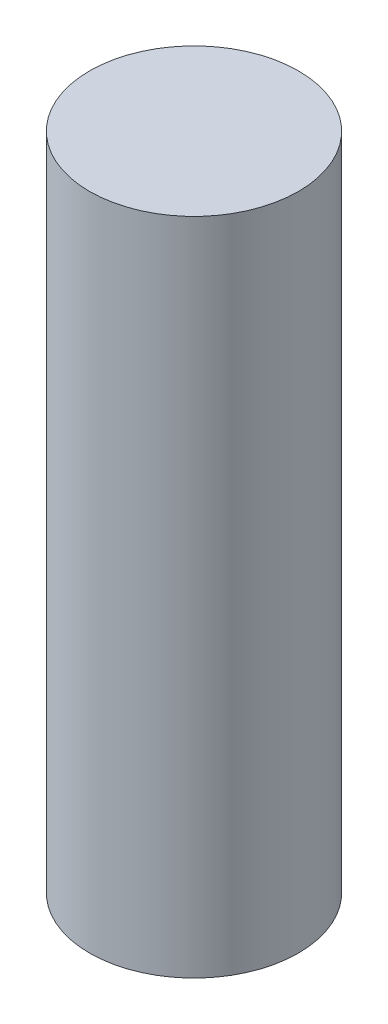
ISO-10303-21;
HEADER;
FILE_DESCRIPTION(('STEP AP214'),'2;1');
FILE_NAME('part.step','',(''),(''),'','','');
FILE_SCHEMA(('AUTOMOTIVE_DESIGN { 1 0 10303 214 1 1 1 1 }'));
ENDSEC;
DATA;
#1=APPLICATION_CONTEXT('core data for automotive mechanical design processes');
#2=APPLICATION_PROTOCOL_DEFINITION('international standard','automotive_design',2000,#1);
#3=PRODUCT_CONTEXT('',#1,'mechanical');
#4=PRODUCT('Part','Part','',(#3));
#5=PRODUCT_RELATED_PRODUCT_CATEGORY('part','',(#4));
#6=PRODUCT_DEFINITION_FORMATION('','',#4);
#7=PRODUCT_DEFINITION_CONTEXT('part definition',#1,'design');
#8=PRODUCT_DEFINITION('design','',#6,#7);
#9=PRODUCT_DEFINITION_SHAPE('','',#8);
#10=(LENGTH_UNIT() NAMED_UNIT(*) SI_UNIT(.MILLI.,.METRE.));
#11=(NAMED_UNIT(*) PLANE_ANGLE_UNIT() SI_UNIT($,.RADIAN.));
#12=(NAMED_UNIT(*) SI_UNIT($,.STERADIAN.) SOLID_ANGLE_UNIT());
#13=UNCERTAINTY_MEASURE_WITH_UNIT(LENGTH_MEASURE(1.E-05),#10,'distance_accuracy_value','');
#14=(GEOMETRIC_REPRESENTATION_CONTEXT(3) GLOBAL_UNCERTAINTY_ASSIGNED_CONTEXT((#13)) GLOBAL_UNIT_ASSIGNED_CONTEXT((#10,
#11,#12)) REPRESENTATION_CONTEXT('',''));
#15=CARTESIAN_POINT('',(0.,0.,0.));
#16=DIRECTION('',(0.,0.,1.));
#17=DIRECTION('',(1.,0.,0.));
#18=AXIS2_PLACEMENT_3D('',#15,#16,#17);
#19=CARTESIAN_POINT('',(0.,120.,0.));
#20=DIRECTION('',(0.,-1.,0.));
#21=DIRECTION('',(0.,0.,-1.));
#22=AXIS2_PLACEMENT_3D('',#19,#20,#21);
#23=CYLINDRICAL_SURFACE('',#22,19.);
#24=CARTESIAN_POINT('',(0.,120.,0.));
#25=DIRECTION('',(0.,1.,0.));
#26=DIRECTION('',(0.,0.,1.));
#27=AXIS2_PLACEMENT_3D('',#24,#25,#26);
#28=CIRCLE('',#27,19.);
#29=CARTESIAN_POINT('',(0.,120.,19.));
#30=VERTEX_POINT('',#29);
#31=EDGE_CURVE('E10',#30,#30,#28,.T.);
#32=ORIENTED_EDGE('',*,*,#31,.F.);
#33=EDGE_LOOP('',(#32));
#34=FACE_BOUND('',#33,.T.);
#35=CARTESIAN_POINT('',(0.,0.,0.));
#36=DIRECTION('',(0.,1.,0.));
#37=DIRECTION('',(0.,0.,1.));
#38=AXIS2_PLACEMENT_3D('',#35,#36,#37);
#39=CIRCLE('',#38,19.);
#40=CARTESIAN_POINT('',(0.,0.,19.));
#41=VERTEX_POINT('',#40);
#42=EDGE_CURVE('E43',#41,#41,#39,.T.);
#43=ORIENTED_EDGE('',*,*,#42,.T.);
#44=EDGE_LOOP('',(#43));
#45=FACE_BOUND('',#44,.T.);
#46=ADVANCED_FACE('F40',(#34,#45),#23,.T.);
#47=CARTESIAN_POINT('',(0.,120.,0.));
#48=DIRECTION('',(0.,1.,0.));
#49=DIRECTION('',(0.,0.,1.));
#50=AXIS2_PLACEMENT_3D('',#47,#48,#49);
#51=PLANE('',#50);
#52=ORIENTED_EDGE('',*,*,#31,.T.);
#53=EDGE_LOOP('',(#52));
#54=FACE_BOUND('',#53,.T.);
#55=ADVANCED_FACE('F57',(#54),#51,.T.);
#56=CARTESIAN_POINT('',(0.,0.,0.));
#57=DIRECTION('',(0.,1.,0.));
#58=DIRECTION('',(0.,0.,1.));
#59=AXIS2_PLACEMENT_3D('',#56,#57,#58);
#60=PLANE('',#59);
#61=ORIENTED_EDGE('',*,*,#42,.F.);
#62=EDGE_LOOP('',(#61));
#63=FACE_BOUND('',#62,.T.);
#64=ADVANCED_FACE('F55',(#63),#60,.F.);
#65=CLOSED_SHELL('',(#46,#55,#64));
#66=MANIFOLD_SOLID_BREP('B2',#65);
#67=ADVANCED_BREP_SHAPE_REPRESENTATION('',(#18,#66),#14);
#68=SHAPE_DEFINITION_REPRESENTATION(#9,#67);
ENDSEC;
END-ISO-10303-21;
